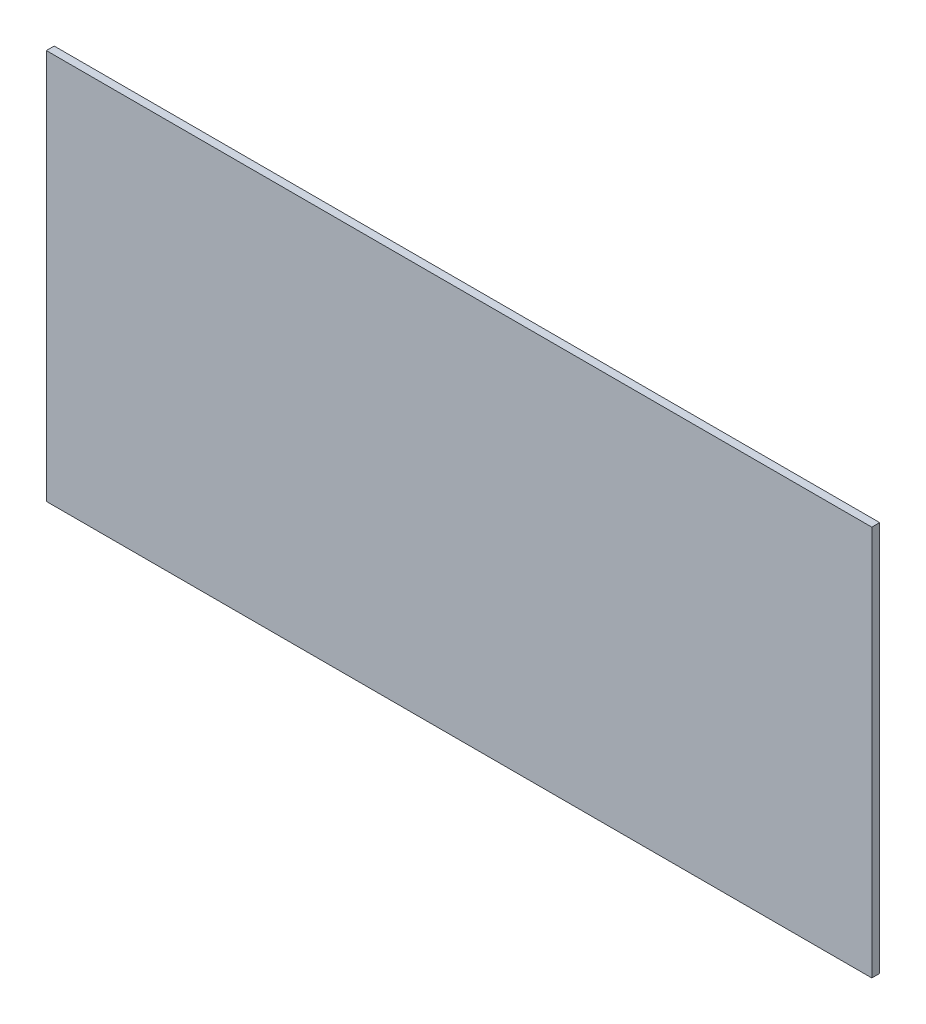
ISO-10303-21;
HEADER;
FILE_DESCRIPTION(('STEP AP214'),'2;1');
FILE_NAME('part.step','',(''),(''),'','','');
FILE_SCHEMA(('AUTOMOTIVE_DESIGN { 1 0 10303 214 1 1 1 1 }'));
ENDSEC;
DATA;
#1=APPLICATION_CONTEXT('core data for automotive mechanical design processes');
#2=APPLICATION_PROTOCOL_DEFINITION('international standard','automotive_design',2000,#1);
#3=PRODUCT_CONTEXT('',#1,'mechanical');
#4=PRODUCT('Part','Part','',(#3));
#5=PRODUCT_RELATED_PRODUCT_CATEGORY('part','',(#4));
#6=PRODUCT_DEFINITION_FORMATION('','',#4);
#7=PRODUCT_DEFINITION_CONTEXT('part definition',#1,'design');
#8=PRODUCT_DEFINITION('design','',#6,#7);
#9=PRODUCT_DEFINITION_SHAPE('','',#8);
#10=(LENGTH_UNIT() NAMED_UNIT(*) SI_UNIT(.MILLI.,.METRE.));
#11=(NAMED_UNIT(*) PLANE_ANGLE_UNIT() SI_UNIT($,.RADIAN.));
#12=(NAMED_UNIT(*) SI_UNIT($,.STERADIAN.) SOLID_ANGLE_UNIT());
#13=UNCERTAINTY_MEASURE_WITH_UNIT(LENGTH_MEASURE(1.E-05),#10,'distance_accuracy_value','');
#14=(GEOMETRIC_REPRESENTATION_CONTEXT(3) GLOBAL_UNCERTAINTY_ASSIGNED_CONTEXT((#13)) GLOBAL_UNIT_ASSIGNED_CONTEXT((#10,
#11,#12)) REPRESENTATION_CONTEXT('',''));
#15=CARTESIAN_POINT('',(0.,0.,0.));
#16=DIRECTION('',(0.,0.,1.));
#17=DIRECTION('',(1.,0.,0.));
#18=AXIS2_PLACEMENT_3D('',#15,#16,#17);
#19=CARTESIAN_POINT('',(0.,0.,-6.));
#20=DIRECTION('',(-1.,0.,0.));
#21=DIRECTION('',(0.,-1.,0.));
#22=AXIS2_PLACEMENT_3D('',#19,#20,#21);
#23=PLANE('',#22);
#24=DIRECTION('',(0.,-1.,0.));
#25=VECTOR('',#24,1.);
#26=CARTESIAN_POINT('',(0.,0.,0.));
#27=LINE('',#26,#25);
#28=CARTESIAN_POINT('',(0.,0.,0.));
#29=VERTEX_POINT('',#28);
#30=CARTESIAN_POINT('',(0.,-298.,0.));
#31=VERTEX_POINT('',#30);
#32=EDGE_CURVE('E102',#29,#31,#27,.T.);
#33=ORIENTED_EDGE('',*,*,#32,.F.);
#34=DIRECTION('',(0.,0.,1.));
#35=VECTOR('',#34,1.);
#36=CARTESIAN_POINT('',(0.,0.,-6.));
#37=LINE('',#36,#35);
#38=CARTESIAN_POINT('',(0.,0.,-6.));
#39=VERTEX_POINT('',#38);
#40=EDGE_CURVE('E11',#39,#29,#37,.T.);
#41=ORIENTED_EDGE('',*,*,#40,.F.);
#42=DIRECTION('',(0.,-1.,0.));
#43=VECTOR('',#42,1.);
#44=CARTESIAN_POINT('',(0.,0.,-6.));
#45=LINE('',#44,#43);
#46=CARTESIAN_POINT('',(0.,-298.,-6.));
#47=VERTEX_POINT('',#46);
#48=EDGE_CURVE('E96',#39,#47,#45,.T.);
#49=ORIENTED_EDGE('',*,*,#48,.T.);
#50=DIRECTION('',(0.,0.,1.));
#51=VECTOR('',#50,1.);
#52=CARTESIAN_POINT('',(0.,-298.,-6.));
#53=LINE('',#52,#51);
#54=EDGE_CURVE('E41',#47,#31,#53,.T.);
#55=ORIENTED_EDGE('',*,*,#54,.T.);
#56=EDGE_LOOP('',(#33,#41,#49,#55));
#57=FACE_BOUND('',#56,.T.);
#58=ADVANCED_FACE('F38',(#57),#23,.T.);
#59=CARTESIAN_POINT('',(0.,0.,-6.));
#60=DIRECTION('',(0.,1.,0.));
#61=DIRECTION('',(0.,0.,1.));
#62=AXIS2_PLACEMENT_3D('',#59,#60,#61);
#63=PLANE('',#62);
#64=DIRECTION('',(-1.,0.,0.));
#65=VECTOR('',#64,1.);
#66=CARTESIAN_POINT('',(0.,0.,0.));
#67=LINE('',#66,#65);
#68=CARTESIAN_POINT('',(630.,0.,0.));
#69=VERTEX_POINT('',#68);
#70=EDGE_CURVE('E98',#69,#29,#67,.T.);
#71=ORIENTED_EDGE('',*,*,#70,.F.);
#72=DIRECTION('',(0.,0.,1.));
#73=VECTOR('',#72,1.);
#74=CARTESIAN_POINT('',(630.,0.,-6.));
#75=LINE('',#74,#73);
#76=CARTESIAN_POINT('',(630.,0.,-6.));
#77=VERTEX_POINT('',#76);
#78=EDGE_CURVE('E47',#77,#69,#75,.T.);
#79=ORIENTED_EDGE('',*,*,#78,.F.);
#80=DIRECTION('',(-1.,0.,0.));
#81=VECTOR('',#80,1.);
#82=CARTESIAN_POINT('',(0.,0.,-6.));
#83=LINE('',#82,#81);
#84=EDGE_CURVE('E93',#77,#39,#83,.T.);
#85=ORIENTED_EDGE('',*,*,#84,.T.);
#86=ORIENTED_EDGE('',*,*,#40,.T.);
#87=EDGE_LOOP('',(#71,#79,#85,#86));
#88=FACE_BOUND('',#87,.T.);
#89=ADVANCED_FACE('F112',(#88),#63,.T.);
#90=CARTESIAN_POINT('',(630.,0.,-6.));
#91=DIRECTION('',(1.,0.,0.));
#92=DIRECTION('',(0.,0.,-1.));
#93=AXIS2_PLACEMENT_3D('',#90,#91,#92);
#94=PLANE('',#93);
#95=DIRECTION('',(0.,1.,0.));
#96=VECTOR('',#95,1.);
#97=CARTESIAN_POINT('',(630.,0.,0.));
#98=LINE('',#97,#96);
#99=CARTESIAN_POINT('',(630.,-298.,0.));
#100=VERTEX_POINT('',#99);
#101=EDGE_CURVE('E88',#100,#69,#98,.T.);
#102=ORIENTED_EDGE('',*,*,#101,.F.);
#103=DIRECTION('',(0.,0.,1.));
#104=VECTOR('',#103,1.);
#105=CARTESIAN_POINT('',(630.,-298.,-6.));
#106=LINE('',#105,#104);
#107=CARTESIAN_POINT('',(630.,-298.,-6.));
#108=VERTEX_POINT('',#107);
#109=EDGE_CURVE('E83',#108,#100,#106,.T.);
#110=ORIENTED_EDGE('',*,*,#109,.F.);
#111=DIRECTION('',(0.,1.,0.));
#112=VECTOR('',#111,1.);
#113=CARTESIAN_POINT('',(630.,0.,-6.));
#114=LINE('',#113,#112);
#115=EDGE_CURVE('E86',#108,#77,#114,.T.);
#116=ORIENTED_EDGE('',*,*,#115,.T.);
#117=ORIENTED_EDGE('',*,*,#78,.T.);
#118=EDGE_LOOP('',(#102,#110,#116,#117));
#119=FACE_BOUND('',#118,.T.);
#120=ADVANCED_FACE('F85',(#119),#94,.T.);
#121=CARTESIAN_POINT('',(0.,-298.,-6.));
#122=DIRECTION('',(0.,-1.,0.));
#123=DIRECTION('',(0.,0.,-1.));
#124=AXIS2_PLACEMENT_3D('',#121,#122,#123);
#125=PLANE('',#124);
#126=DIRECTION('',(1.,0.,0.));
#127=VECTOR('',#126,1.);
#128=CARTESIAN_POINT('',(0.,-298.,0.));
#129=LINE('',#128,#127);
#130=EDGE_CURVE('E105',#31,#100,#129,.T.);
#131=ORIENTED_EDGE('',*,*,#130,.F.);
#132=ORIENTED_EDGE('',*,*,#54,.F.);
#133=DIRECTION('',(1.,0.,0.));
#134=VECTOR('',#133,1.);
#135=CARTESIAN_POINT('',(0.,-298.,-6.));
#136=LINE('',#135,#134);
#137=EDGE_CURVE('E92',#47,#108,#136,.T.);
#138=ORIENTED_EDGE('',*,*,#137,.T.);
#139=ORIENTED_EDGE('',*,*,#109,.T.);
#140=EDGE_LOOP('',(#131,#132,#138,#139));
#141=FACE_BOUND('',#140,.T.);
#142=ADVANCED_FACE('F95',(#141),#125,.T.);
#143=CARTESIAN_POINT('',(0.,0.,-6.));
#144=DIRECTION('',(0.,0.,1.));
#145=DIRECTION('',(1.,0.,0.));
#146=AXIS2_PLACEMENT_3D('',#143,#144,#145);
#147=PLANE('',#146);
#148=ORIENTED_EDGE('',*,*,#48,.F.);
#149=ORIENTED_EDGE('',*,*,#84,.F.);
#150=ORIENTED_EDGE('',*,*,#115,.F.);
#151=ORIENTED_EDGE('',*,*,#137,.F.);
#152=EDGE_LOOP('',(#148,#149,#150,#151));
#153=FACE_BOUND('',#152,.T.);
#154=ADVANCED_FACE('F91',(#153),#147,.F.);
#155=CARTESIAN_POINT('',(0.,0.,0.));
#156=DIRECTION('',(0.,0.,1.));
#157=DIRECTION('',(1.,0.,0.));
#158=AXIS2_PLACEMENT_3D('',#155,#156,#157);
#159=PLANE('',#158);
#160=ORIENTED_EDGE('',*,*,#32,.T.);
#161=ORIENTED_EDGE('',*,*,#130,.T.);
#162=ORIENTED_EDGE('',*,*,#101,.T.);
#163=ORIENTED_EDGE('',*,*,#70,.T.);
#164=EDGE_LOOP('',(#160,#161,#162,#163));
#165=FACE_BOUND('',#164,.T.);
#166=ADVANCED_FACE('F111',(#165),#159,.T.);
#167=CLOSED_SHELL('',(#58,#89,#120,#142,#154,#166));
#168=MANIFOLD_SOLID_BREP('B2',#167);
#169=ADVANCED_BREP_SHAPE_REPRESENTATION('',(#18,#168),#14);
#170=SHAPE_DEFINITION_REPRESENTATION(#9,#169);
ENDSEC;
END-ISO-10303-21;
